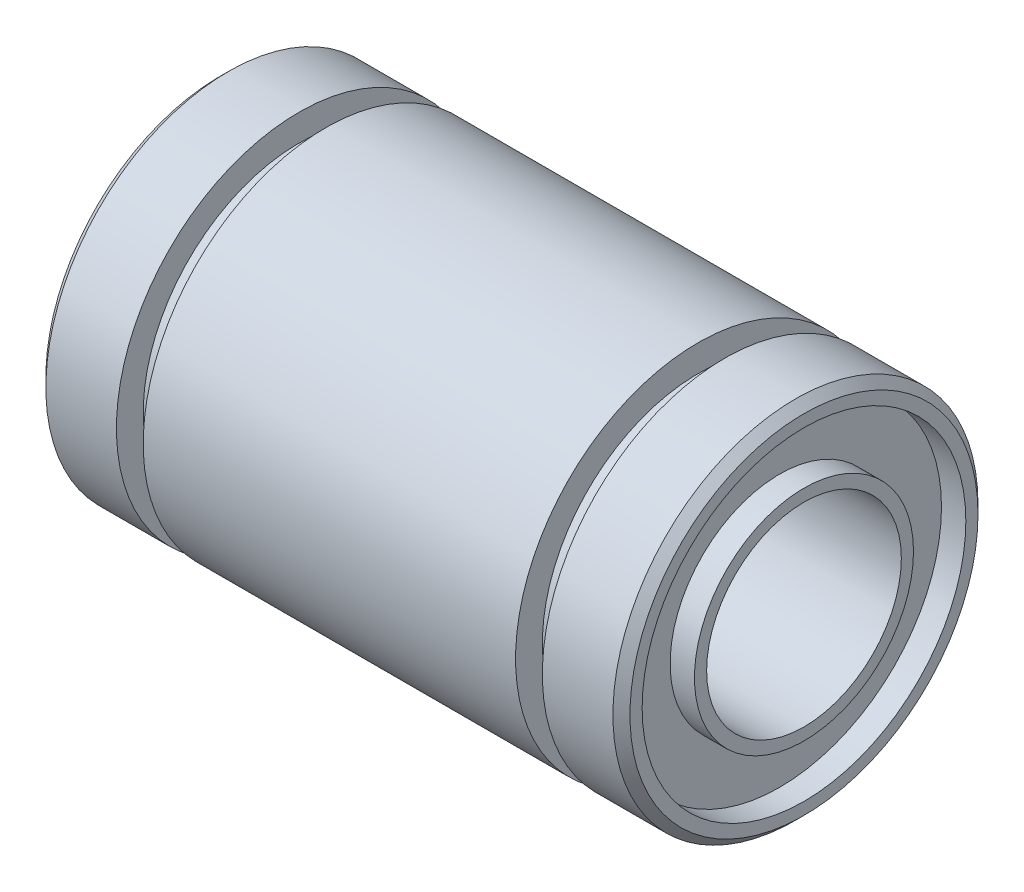
ISO-10303-21;
HEADER;
FILE_DESCRIPTION(('STEP AP214'),'2;1');
FILE_NAME('part.step','',(''),(''),'','','');
FILE_SCHEMA(('AUTOMOTIVE_DESIGN { 1 0 10303 214 1 1 1 1 }'));
ENDSEC;
DATA;
#1=APPLICATION_CONTEXT('core data for automotive mechanical design processes');
#2=APPLICATION_PROTOCOL_DEFINITION('international standard','automotive_design',2000,#1);
#3=PRODUCT_CONTEXT('',#1,'mechanical');
#4=PRODUCT('Part','Part','',(#3));
#5=PRODUCT_RELATED_PRODUCT_CATEGORY('part','',(#4));
#6=PRODUCT_DEFINITION_FORMATION('','',#4);
#7=PRODUCT_DEFINITION_CONTEXT('part definition',#1,'design');
#8=PRODUCT_DEFINITION('design','',#6,#7);
#9=PRODUCT_DEFINITION_SHAPE('','',#8);
#10=(LENGTH_UNIT() NAMED_UNIT(*) SI_UNIT(.MILLI.,.METRE.));
#11=(NAMED_UNIT(*) PLANE_ANGLE_UNIT() SI_UNIT($,.RADIAN.));
#12=(NAMED_UNIT(*) SI_UNIT($,.STERADIAN.) SOLID_ANGLE_UNIT());
#13=UNCERTAINTY_MEASURE_WITH_UNIT(LENGTH_MEASURE(1.E-05),#10,'distance_accuracy_value','');
#14=(GEOMETRIC_REPRESENTATION_CONTEXT(3) GLOBAL_UNCERTAINTY_ASSIGNED_CONTEXT((#13)) GLOBAL_UNIT_ASSIGNED_CONTEXT((#10,
#11,#12)) REPRESENTATION_CONTEXT('',''));
#15=CARTESIAN_POINT('',(0.,0.,0.));
#16=DIRECTION('',(0.,0.,1.));
#17=DIRECTION('',(1.,0.,0.));
#18=AXIS2_PLACEMENT_3D('',#15,#16,#17);
#19=CARTESIAN_POINT('',(11.65,0.,0.));
#20=DIRECTION('',(-1.,0.,0.));
#21=DIRECTION('',(0.,0.,-1.));
#22=AXIS2_PLACEMENT_3D('',#19,#20,#21);
#23=CONICAL_SURFACE('',#22,7.5,0.78539816339745);
#24=CARTESIAN_POINT('',(12.,0.,0.));
#25=DIRECTION('',(1.,0.,0.));
#26=DIRECTION('',(0.,0.,-1.));
#27=AXIS2_PLACEMENT_3D('',#24,#25,#26);
#28=CIRCLE('',#27,7.15);
#29=CARTESIAN_POINT('',(12.,0.,-7.15));
#30=VERTEX_POINT('',#29);
#31=EDGE_CURVE('E109',#30,#30,#28,.T.);
#32=ORIENTED_EDGE('',*,*,#31,.F.);
#33=EDGE_LOOP('',(#32));
#34=FACE_BOUND('',#33,.T.);
#35=CARTESIAN_POINT('',(11.65,0.,0.));
#36=DIRECTION('',(1.,0.,0.));
#37=DIRECTION('',(0.,0.,-1.));
#38=AXIS2_PLACEMENT_3D('',#35,#36,#37);
#39=CIRCLE('',#38,7.5);
#40=CARTESIAN_POINT('',(11.65,0.,-7.5));
#41=VERTEX_POINT('',#40);
#42=EDGE_CURVE('E10',#41,#41,#39,.T.);
#43=ORIENTED_EDGE('',*,*,#42,.T.);
#44=EDGE_LOOP('',(#43));
#45=FACE_BOUND('',#44,.T.);
#46=ADVANCED_FACE('F39',(#34,#45),#23,.T.);
#47=CARTESIAN_POINT('',(-45.6895053247726,0.,0.));
#48=DIRECTION('',(-1.,0.,0.));
#49=DIRECTION('',(0.,0.,-1.));
#50=AXIS2_PLACEMENT_3D('',#47,#48,#49);
#51=CYLINDRICAL_SURFACE('',#50,7.5);
#52=CARTESIAN_POINT('',(8.75000000000001,0.,0.));
#53=DIRECTION('',(1.,0.,0.));
#54=DIRECTION('',(0.,0.,-1.));
#55=AXIS2_PLACEMENT_3D('',#52,#53,#54);
#56=CIRCLE('',#55,7.5);
#57=CARTESIAN_POINT('',(8.75000000000001,0.,-7.5));
#58=VERTEX_POINT('',#57);
#59=EDGE_CURVE('E45',#58,#58,#56,.T.);
#60=ORIENTED_EDGE('',*,*,#59,.T.);
#61=EDGE_LOOP('',(#60));
#62=FACE_BOUND('',#61,.T.);
#63=ORIENTED_EDGE('',*,*,#42,.F.);
#64=EDGE_LOOP('',(#63));
#65=FACE_BOUND('',#64,.T.);
#66=ADVANCED_FACE('F116',(#62,#65),#51,.T.);
#67=CARTESIAN_POINT('',(8.75000000000001,0.,0.));
#68=DIRECTION('',(1.,0.,0.));
#69=DIRECTION('',(0.,0.,1.));
#70=AXIS2_PLACEMENT_3D('',#67,#68,#69);
#71=PLANE('',#70);
#72=CARTESIAN_POINT('',(8.75000000000001,0.,0.));
#73=DIRECTION('',(1.,0.,0.));
#74=DIRECTION('',(0.,0.,-1.));
#75=AXIS2_PLACEMENT_3D('',#72,#73,#74);
#76=CIRCLE('',#75,6.4);
#77=CARTESIAN_POINT('',(8.75000000000001,0.,-6.4));
#78=VERTEX_POINT('',#77);
#79=EDGE_CURVE('E49',#78,#78,#76,.T.);
#80=ORIENTED_EDGE('',*,*,#79,.T.);
#81=EDGE_LOOP('',(#80));
#82=FACE_BOUND('',#81,.T.);
#83=ORIENTED_EDGE('',*,*,#59,.F.);
#84=EDGE_LOOP('',(#83));
#85=FACE_BOUND('',#84,.T.);
#86=ADVANCED_FACE('F120',(#82,#85),#71,.F.);
#87=CARTESIAN_POINT('',(-45.6895053247726,0.,0.));
#88=DIRECTION('',(-1.,0.,0.));
#89=DIRECTION('',(0.,0.,-1.));
#90=AXIS2_PLACEMENT_3D('',#87,#88,#89);
#91=CYLINDRICAL_SURFACE('',#90,6.4);
#92=CARTESIAN_POINT('',(7.65,0.,0.));
#93=DIRECTION('',(1.,0.,0.));
#94=DIRECTION('',(0.,0.,-1.));
#95=AXIS2_PLACEMENT_3D('',#92,#93,#94);
#96=CIRCLE('',#95,6.4);
#97=CARTESIAN_POINT('',(7.65,0.,-6.4));
#98=VERTEX_POINT('',#97);
#99=EDGE_CURVE('E53',#98,#98,#96,.T.);
#100=ORIENTED_EDGE('',*,*,#99,.T.);
#101=EDGE_LOOP('',(#100));
#102=FACE_BOUND('',#101,.T.);
#103=ORIENTED_EDGE('',*,*,#79,.F.);
#104=EDGE_LOOP('',(#103));
#105=FACE_BOUND('',#104,.T.);
#106=ADVANCED_FACE('F124',(#102,#105),#91,.T.);
#107=CARTESIAN_POINT('',(7.65,0.,0.));
#108=DIRECTION('',(-1.,0.,0.));
#109=DIRECTION('',(0.,0.,-1.));
#110=AXIS2_PLACEMENT_3D('',#107,#108,#109);
#111=PLANE('',#110);
#112=CARTESIAN_POINT('',(7.65,0.,0.));
#113=DIRECTION('',(1.,0.,0.));
#114=DIRECTION('',(0.,0.,-1.));
#115=AXIS2_PLACEMENT_3D('',#112,#113,#114);
#116=CIRCLE('',#115,7.5);
#117=CARTESIAN_POINT('',(7.65,0.,-7.5));
#118=VERTEX_POINT('',#117);
#119=EDGE_CURVE('E58',#118,#118,#116,.T.);
#120=ORIENTED_EDGE('',*,*,#119,.T.);
#121=EDGE_LOOP('',(#120));
#122=FACE_BOUND('',#121,.T.);
#123=ORIENTED_EDGE('',*,*,#99,.F.);
#124=EDGE_LOOP('',(#123));
#125=FACE_BOUND('',#124,.T.);
#126=ADVANCED_FACE('F131',(#122,#125),#111,.F.);
#127=CARTESIAN_POINT('',(-45.6895053247726,0.,0.));
#128=DIRECTION('',(-1.,0.,0.));
#129=DIRECTION('',(0.,0.,-1.));
#130=AXIS2_PLACEMENT_3D('',#127,#128,#129);
#131=CYLINDRICAL_SURFACE('',#130,7.5);
#132=ORIENTED_EDGE('',*,*,#119,.F.);
#133=EDGE_LOOP('',(#132));
#134=FACE_BOUND('',#133,.T.);
#135=CARTESIAN_POINT('',(-7.65,0.,0.));
#136=DIRECTION('',(1.,0.,0.));
#137=DIRECTION('',(0.,0.,-1.));
#138=AXIS2_PLACEMENT_3D('',#135,#136,#137);
#139=CIRCLE('',#138,7.5);
#140=CARTESIAN_POINT('',(-7.65,0.,-7.5));
#141=VERTEX_POINT('',#140);
#142=EDGE_CURVE('E61',#141,#141,#139,.T.);
#143=ORIENTED_EDGE('',*,*,#142,.T.);
#144=EDGE_LOOP('',(#143));
#145=FACE_BOUND('',#144,.T.);
#146=ADVANCED_FACE('F135',(#134,#145),#131,.T.);
#147=CARTESIAN_POINT('',(-7.65,0.,0.));
#148=DIRECTION('',(-1.,0.,0.));
#149=DIRECTION('',(0.,0.,-1.));
#150=AXIS2_PLACEMENT_3D('',#147,#148,#149);
#151=PLANE('',#150);
#152=ORIENTED_EDGE('',*,*,#142,.F.);
#153=EDGE_LOOP('',(#152));
#154=FACE_BOUND('',#153,.T.);
#155=CARTESIAN_POINT('',(-7.65,0.,0.));
#156=DIRECTION('',(1.,0.,0.));
#157=DIRECTION('',(0.,0.,-1.));
#158=AXIS2_PLACEMENT_3D('',#155,#156,#157);
#159=CIRCLE('',#158,6.4);
#160=CARTESIAN_POINT('',(-7.65,0.,-6.4));
#161=VERTEX_POINT('',#160);
#162=EDGE_CURVE('E64',#161,#161,#159,.T.);
#163=ORIENTED_EDGE('',*,*,#162,.T.);
#164=EDGE_LOOP('',(#163));
#165=FACE_BOUND('',#164,.T.);
#166=ADVANCED_FACE('F139',(#154,#165),#151,.T.);
#167=CARTESIAN_POINT('',(-45.6895053247726,0.,0.));
#168=DIRECTION('',(-1.,0.,0.));
#169=DIRECTION('',(0.,0.,-1.));
#170=AXIS2_PLACEMENT_3D('',#167,#168,#169);
#171=CYLINDRICAL_SURFACE('',#170,6.4);
#172=ORIENTED_EDGE('',*,*,#162,.F.);
#173=EDGE_LOOP('',(#172));
#174=FACE_BOUND('',#173,.T.);
#175=CARTESIAN_POINT('',(-8.74999999999999,0.,0.));
#176=DIRECTION('',(1.,0.,0.));
#177=DIRECTION('',(0.,0.,-1.));
#178=AXIS2_PLACEMENT_3D('',#175,#176,#177);
#179=CIRCLE('',#178,6.4);
#180=CARTESIAN_POINT('',(-8.74999999999999,0.,-6.4));
#181=VERTEX_POINT('',#180);
#182=EDGE_CURVE('E67',#181,#181,#179,.T.);
#183=ORIENTED_EDGE('',*,*,#182,.T.);
#184=EDGE_LOOP('',(#183));
#185=FACE_BOUND('',#184,.T.);
#186=ADVANCED_FACE('F143',(#174,#185),#171,.T.);
#187=CARTESIAN_POINT('',(-8.75,0.,0.));
#188=DIRECTION('',(1.,0.,0.));
#189=DIRECTION('',(0.,0.,1.));
#190=AXIS2_PLACEMENT_3D('',#187,#188,#189);
#191=PLANE('',#190);
#192=ORIENTED_EDGE('',*,*,#182,.F.);
#193=EDGE_LOOP('',(#192));
#194=FACE_BOUND('',#193,.T.);
#195=CARTESIAN_POINT('',(-8.74999999999999,0.,0.));
#196=DIRECTION('',(1.,0.,0.));
#197=DIRECTION('',(0.,0.,-1.));
#198=AXIS2_PLACEMENT_3D('',#195,#196,#197);
#199=CIRCLE('',#198,7.5);
#200=CARTESIAN_POINT('',(-8.74999999999999,0.,-7.5));
#201=VERTEX_POINT('',#200);
#202=EDGE_CURVE('E70',#201,#201,#199,.T.);
#203=ORIENTED_EDGE('',*,*,#202,.T.);
#204=EDGE_LOOP('',(#203));
#205=FACE_BOUND('',#204,.T.);
#206=ADVANCED_FACE('F147',(#194,#205),#191,.T.);
#207=CARTESIAN_POINT('',(-45.6895053247726,0.,0.));
#208=DIRECTION('',(-1.,0.,0.));
#209=DIRECTION('',(0.,0.,-1.));
#210=AXIS2_PLACEMENT_3D('',#207,#208,#209);
#211=CYLINDRICAL_SURFACE('',#210,7.5);
#212=ORIENTED_EDGE('',*,*,#202,.F.);
#213=EDGE_LOOP('',(#212));
#214=FACE_BOUND('',#213,.T.);
#215=CARTESIAN_POINT('',(-11.65,0.,0.));
#216=DIRECTION('',(1.,0.,0.));
#217=DIRECTION('',(0.,0.,-1.));
#218=AXIS2_PLACEMENT_3D('',#215,#216,#217);
#219=CIRCLE('',#218,7.5);
#220=CARTESIAN_POINT('',(-11.65,0.,-7.5));
#221=VERTEX_POINT('',#220);
#222=EDGE_CURVE('E73',#221,#221,#219,.T.);
#223=ORIENTED_EDGE('',*,*,#222,.T.);
#224=EDGE_LOOP('',(#223));
#225=FACE_BOUND('',#224,.T.);
#226=ADVANCED_FACE('F151',(#214,#225),#211,.T.);
#227=CARTESIAN_POINT('',(-11.65,0.,0.));
#228=DIRECTION('',(1.,0.,0.));
#229=DIRECTION('',(0.,0.,1.));
#230=AXIS2_PLACEMENT_3D('',#227,#228,#229);
#231=CONICAL_SURFACE('',#230,7.5,0.78539816339745);
#232=CARTESIAN_POINT('',(-12.,0.,0.));
#233=DIRECTION('',(1.,0.,0.));
#234=DIRECTION('',(0.,0.,-1.));
#235=AXIS2_PLACEMENT_3D('',#232,#233,#234);
#236=CIRCLE('',#235,7.15);
#237=CARTESIAN_POINT('',(-12.,0.,-7.15));
#238=VERTEX_POINT('',#237);
#239=EDGE_CURVE('E76',#238,#238,#236,.T.);
#240=ORIENTED_EDGE('',*,*,#239,.T.);
#241=EDGE_LOOP('',(#240));
#242=FACE_BOUND('',#241,.T.);
#243=ORIENTED_EDGE('',*,*,#222,.F.);
#244=EDGE_LOOP('',(#243));
#245=FACE_BOUND('',#244,.T.);
#246=ADVANCED_FACE('F155',(#242,#245),#231,.T.);
#247=CARTESIAN_POINT('',(-12.,0.,0.));
#248=DIRECTION('',(1.,0.,0.));
#249=DIRECTION('',(0.,0.,1.));
#250=AXIS2_PLACEMENT_3D('',#247,#248,#249);
#251=PLANE('',#250);
#252=CARTESIAN_POINT('',(-12.,0.,0.));
#253=DIRECTION('',(1.,0.,0.));
#254=DIRECTION('',(0.,0.,-1.));
#255=AXIS2_PLACEMENT_3D('',#252,#253,#254);
#256=CIRCLE('',#255,6.65);
#257=CARTESIAN_POINT('',(-12.,0.,-6.65));
#258=VERTEX_POINT('',#257);
#259=EDGE_CURVE('E79',#258,#258,#256,.T.);
#260=ORIENTED_EDGE('',*,*,#259,.T.);
#261=EDGE_LOOP('',(#260));
#262=FACE_BOUND('',#261,.T.);
#263=ORIENTED_EDGE('',*,*,#239,.F.);
#264=EDGE_LOOP('',(#263));
#265=FACE_BOUND('',#264,.T.);
#266=ADVANCED_FACE('F159',(#262,#265),#251,.F.);
#267=CARTESIAN_POINT('',(-45.6895053247726,0.,0.));
#268=DIRECTION('',(-1.,0.,0.));
#269=DIRECTION('',(0.,0.,-1.));
#270=AXIS2_PLACEMENT_3D('',#267,#268,#269);
#271=CYLINDRICAL_SURFACE('',#270,6.65);
#272=CARTESIAN_POINT('',(-11.,0.,0.));
#273=DIRECTION('',(1.,0.,0.));
#274=DIRECTION('',(0.,0.,-1.));
#275=AXIS2_PLACEMENT_3D('',#272,#273,#274);
#276=CIRCLE('',#275,6.65);
#277=CARTESIAN_POINT('',(-11.,0.,-6.65));
#278=VERTEX_POINT('',#277);
#279=EDGE_CURVE('E82',#278,#278,#276,.T.);
#280=ORIENTED_EDGE('',*,*,#279,.T.);
#281=EDGE_LOOP('',(#280));
#282=FACE_BOUND('',#281,.T.);
#283=ORIENTED_EDGE('',*,*,#259,.F.);
#284=EDGE_LOOP('',(#283));
#285=FACE_BOUND('',#284,.T.);
#286=ADVANCED_FACE('F163',(#282,#285),#271,.F.);
#287=CARTESIAN_POINT('',(-11.,0.,0.));
#288=DIRECTION('',(1.,0.,0.));
#289=DIRECTION('',(0.,0.,1.));
#290=AXIS2_PLACEMENT_3D('',#287,#288,#289);
#291=PLANE('',#290);
#292=CARTESIAN_POINT('',(-11.,0.,0.));
#293=DIRECTION('',(1.,0.,0.));
#294=DIRECTION('',(0.,0.,-1.));
#295=AXIS2_PLACEMENT_3D('',#292,#293,#294);
#296=CIRCLE('',#295,4.5);
#297=CARTESIAN_POINT('',(-11.,0.,-4.5));
#298=VERTEX_POINT('',#297);
#299=EDGE_CURVE('E85',#298,#298,#296,.T.);
#300=ORIENTED_EDGE('',*,*,#299,.T.);
#301=EDGE_LOOP('',(#300));
#302=FACE_BOUND('',#301,.T.);
#303=ORIENTED_EDGE('',*,*,#279,.F.);
#304=EDGE_LOOP('',(#303));
#305=FACE_BOUND('',#304,.T.);
#306=ADVANCED_FACE('F167',(#302,#305),#291,.F.);
#307=CARTESIAN_POINT('',(-45.6895053247726,0.,0.));
#308=DIRECTION('',(-1.,0.,0.));
#309=DIRECTION('',(0.,0.,-1.));
#310=AXIS2_PLACEMENT_3D('',#307,#308,#309);
#311=CYLINDRICAL_SURFACE('',#310,4.5);
#312=CARTESIAN_POINT('',(-12.,0.,0.));
#313=DIRECTION('',(1.,0.,0.));
#314=DIRECTION('',(0.,0.,-1.));
#315=AXIS2_PLACEMENT_3D('',#312,#313,#314);
#316=CIRCLE('',#315,4.5);
#317=CARTESIAN_POINT('',(-12.,0.,-4.5));
#318=VERTEX_POINT('',#317);
#319=EDGE_CURVE('E88',#318,#318,#316,.T.);
#320=ORIENTED_EDGE('',*,*,#319,.T.);
#321=EDGE_LOOP('',(#320));
#322=FACE_BOUND('',#321,.T.);
#323=ORIENTED_EDGE('',*,*,#299,.F.);
#324=EDGE_LOOP('',(#323));
#325=FACE_BOUND('',#324,.T.);
#326=ADVANCED_FACE('F171',(#322,#325),#311,.T.);
#327=CARTESIAN_POINT('',(-12.,0.,0.));
#328=DIRECTION('',(1.,0.,0.));
#329=DIRECTION('',(0.,0.,1.));
#330=AXIS2_PLACEMENT_3D('',#327,#328,#329);
#331=PLANE('',#330);
#332=CARTESIAN_POINT('',(-12.,0.,0.));
#333=DIRECTION('',(1.,0.,0.));
#334=DIRECTION('',(0.,0.,-1.));
#335=AXIS2_PLACEMENT_3D('',#332,#333,#334);
#336=CIRCLE('',#335,4.);
#337=CARTESIAN_POINT('',(-12.,0.,-4.));
#338=VERTEX_POINT('',#337);
#339=EDGE_CURVE('E91',#338,#338,#336,.T.);
#340=ORIENTED_EDGE('',*,*,#339,.T.);
#341=EDGE_LOOP('',(#340));
#342=FACE_BOUND('',#341,.T.);
#343=ORIENTED_EDGE('',*,*,#319,.F.);
#344=EDGE_LOOP('',(#343));
#345=FACE_BOUND('',#344,.T.);
#346=ADVANCED_FACE('F175',(#342,#345),#331,.F.);
#347=CARTESIAN_POINT('',(-45.6895053247726,0.,0.));
#348=DIRECTION('',(-1.,0.,0.));
#349=DIRECTION('',(0.,0.,-1.));
#350=AXIS2_PLACEMENT_3D('',#347,#348,#349);
#351=CYLINDRICAL_SURFACE('',#350,4.);
#352=CARTESIAN_POINT('',(12.,0.,0.));
#353=DIRECTION('',(1.,0.,0.));
#354=DIRECTION('',(0.,0.,-1.));
#355=AXIS2_PLACEMENT_3D('',#352,#353,#354);
#356=CIRCLE('',#355,4.);
#357=CARTESIAN_POINT('',(12.,0.,-4.));
#358=VERTEX_POINT('',#357);
#359=EDGE_CURVE('E94',#358,#358,#356,.T.);
#360=ORIENTED_EDGE('',*,*,#359,.T.);
#361=EDGE_LOOP('',(#360));
#362=FACE_BOUND('',#361,.T.);
#363=ORIENTED_EDGE('',*,*,#339,.F.);
#364=EDGE_LOOP('',(#363));
#365=FACE_BOUND('',#364,.T.);
#366=ADVANCED_FACE('F179',(#362,#365),#351,.F.);
#367=CARTESIAN_POINT('',(12.,0.,0.));
#368=DIRECTION('',(1.,0.,0.));
#369=DIRECTION('',(0.,0.,1.));
#370=AXIS2_PLACEMENT_3D('',#367,#368,#369);
#371=PLANE('',#370);
#372=ORIENTED_EDGE('',*,*,#359,.F.);
#373=EDGE_LOOP('',(#372));
#374=FACE_BOUND('',#373,.T.);
#375=CARTESIAN_POINT('',(12.,0.,0.));
#376=DIRECTION('',(1.,0.,0.));
#377=DIRECTION('',(0.,0.,-1.));
#378=AXIS2_PLACEMENT_3D('',#375,#376,#377);
#379=CIRCLE('',#378,4.5);
#380=CARTESIAN_POINT('',(12.,0.,-4.5));
#381=VERTEX_POINT('',#380);
#382=EDGE_CURVE('E97',#381,#381,#379,.T.);
#383=ORIENTED_EDGE('',*,*,#382,.T.);
#384=EDGE_LOOP('',(#383));
#385=FACE_BOUND('',#384,.T.);
#386=ADVANCED_FACE('F183',(#374,#385),#371,.T.);
#387=CARTESIAN_POINT('',(-45.6895053247726,0.,0.));
#388=DIRECTION('',(-1.,0.,0.));
#389=DIRECTION('',(0.,0.,-1.));
#390=AXIS2_PLACEMENT_3D('',#387,#388,#389);
#391=CYLINDRICAL_SURFACE('',#390,4.5);
#392=ORIENTED_EDGE('',*,*,#382,.F.);
#393=EDGE_LOOP('',(#392));
#394=FACE_BOUND('',#393,.T.);
#395=CARTESIAN_POINT('',(11.,0.,0.));
#396=DIRECTION('',(1.,0.,0.));
#397=DIRECTION('',(0.,0.,-1.));
#398=AXIS2_PLACEMENT_3D('',#395,#396,#397);
#399=CIRCLE('',#398,4.5);
#400=CARTESIAN_POINT('',(11.,0.,-4.5));
#401=VERTEX_POINT('',#400);
#402=EDGE_CURVE('E100',#401,#401,#399,.T.);
#403=ORIENTED_EDGE('',*,*,#402,.T.);
#404=EDGE_LOOP('',(#403));
#405=FACE_BOUND('',#404,.T.);
#406=ADVANCED_FACE('F187',(#394,#405),#391,.T.);
#407=CARTESIAN_POINT('',(11.,0.,0.));
#408=DIRECTION('',(1.,0.,0.));
#409=DIRECTION('',(0.,0.,1.));
#410=AXIS2_PLACEMENT_3D('',#407,#408,#409);
#411=PLANE('',#410);
#412=ORIENTED_EDGE('',*,*,#402,.F.);
#413=EDGE_LOOP('',(#412));
#414=FACE_BOUND('',#413,.T.);
#415=CARTESIAN_POINT('',(11.,0.,0.));
#416=DIRECTION('',(1.,0.,0.));
#417=DIRECTION('',(0.,0.,-1.));
#418=AXIS2_PLACEMENT_3D('',#415,#416,#417);
#419=CIRCLE('',#418,6.65);
#420=CARTESIAN_POINT('',(11.,0.,-6.65));
#421=VERTEX_POINT('',#420);
#422=EDGE_CURVE('E103',#421,#421,#419,.T.);
#423=ORIENTED_EDGE('',*,*,#422,.T.);
#424=EDGE_LOOP('',(#423));
#425=FACE_BOUND('',#424,.T.);
#426=ADVANCED_FACE('F191',(#414,#425),#411,.T.);
#427=CARTESIAN_POINT('',(-45.6895053247726,0.,0.));
#428=DIRECTION('',(-1.,0.,0.));
#429=DIRECTION('',(0.,0.,-1.));
#430=AXIS2_PLACEMENT_3D('',#427,#428,#429);
#431=CYLINDRICAL_SURFACE('',#430,6.65);
#432=ORIENTED_EDGE('',*,*,#422,.F.);
#433=EDGE_LOOP('',(#432));
#434=FACE_BOUND('',#433,.T.);
#435=CARTESIAN_POINT('',(12.,0.,0.));
#436=DIRECTION('',(1.,0.,0.));
#437=DIRECTION('',(0.,0.,-1.));
#438=AXIS2_PLACEMENT_3D('',#435,#436,#437);
#439=CIRCLE('',#438,6.65);
#440=CARTESIAN_POINT('',(12.,0.,-6.65));
#441=VERTEX_POINT('',#440);
#442=EDGE_CURVE('E106',#441,#441,#439,.T.);
#443=ORIENTED_EDGE('',*,*,#442,.T.);
#444=EDGE_LOOP('',(#443));
#445=FACE_BOUND('',#444,.T.);
#446=ADVANCED_FACE('F195',(#434,#445),#431,.F.);
#447=CARTESIAN_POINT('',(12.,0.,0.));
#448=DIRECTION('',(1.,0.,0.));
#449=DIRECTION('',(0.,0.,1.));
#450=AXIS2_PLACEMENT_3D('',#447,#448,#449);
#451=PLANE('',#450);
#452=ORIENTED_EDGE('',*,*,#442,.F.);
#453=EDGE_LOOP('',(#452));
#454=FACE_BOUND('',#453,.T.);
#455=ORIENTED_EDGE('',*,*,#31,.T.);
#456=EDGE_LOOP('',(#455));
#457=FACE_BOUND('',#456,.T.);
#458=ADVANCED_FACE('F113',(#454,#457),#451,.T.);
#459=CLOSED_SHELL('',(#46,#66,#86,#106,#126,#146,#166,#186,#206,#226,#246,#266,#286,#306,#326,
#346,#366,#386,#406,#426,#446,#458));
#460=MANIFOLD_SOLID_BREP('B2',#459);
#461=ADVANCED_BREP_SHAPE_REPRESENTATION('',(#18,#460),#14);
#462=SHAPE_DEFINITION_REPRESENTATION(#9,#461);
ENDSEC;
END-ISO-10303-21;
